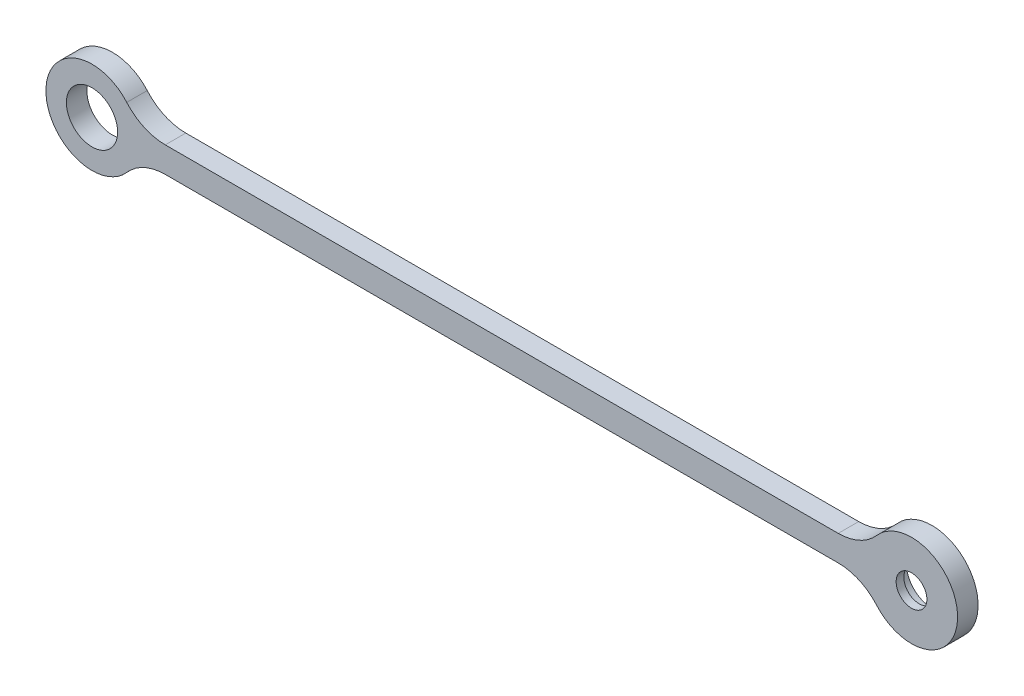
ISO-10303-21;
HEADER;
FILE_DESCRIPTION(('STEP AP214'),'2;1');
FILE_NAME('part.step','',(''),(''),'','','');
FILE_SCHEMA(('AUTOMOTIVE_DESIGN { 1 0 10303 214 1 1 1 1 }'));
ENDSEC;
DATA;
#1=APPLICATION_CONTEXT('core data for automotive mechanical design processes');
#2=APPLICATION_PROTOCOL_DEFINITION('international standard','automotive_design',2000,#1);
#3=PRODUCT_CONTEXT('',#1,'mechanical');
#4=PRODUCT('Part','Part','',(#3));
#5=PRODUCT_RELATED_PRODUCT_CATEGORY('part','',(#4));
#6=PRODUCT_DEFINITION_FORMATION('','',#4);
#7=PRODUCT_DEFINITION_CONTEXT('part definition',#1,'design');
#8=PRODUCT_DEFINITION('design','',#6,#7);
#9=PRODUCT_DEFINITION_SHAPE('','',#8);
#10=(LENGTH_UNIT() NAMED_UNIT(*) SI_UNIT(.MILLI.,.METRE.));
#11=(NAMED_UNIT(*) PLANE_ANGLE_UNIT() SI_UNIT($,.RADIAN.));
#12=(NAMED_UNIT(*) SI_UNIT($,.STERADIAN.) SOLID_ANGLE_UNIT());
#13=UNCERTAINTY_MEASURE_WITH_UNIT(LENGTH_MEASURE(1.E-05),#10,'distance_accuracy_value','');
#14=(GEOMETRIC_REPRESENTATION_CONTEXT(3) GLOBAL_UNCERTAINTY_ASSIGNED_CONTEXT((#13)) GLOBAL_UNIT_ASSIGNED_CONTEXT((#10,
#11,#12)) REPRESENTATION_CONTEXT('',''));
#15=CARTESIAN_POINT('',(0.,0.,0.));
#16=DIRECTION('',(0.,0.,1.));
#17=DIRECTION('',(1.,0.,0.));
#18=AXIS2_PLACEMENT_3D('',#15,#16,#17);
#19=CARTESIAN_POINT('',(160.,0.,4.));
#20=DIRECTION('',(0.,0.,-1.));
#21=DIRECTION('',(-1.,0.,0.));
#22=AXIS2_PLACEMENT_3D('',#19,#20,#21);
#23=CYLINDRICAL_SURFACE('',#22,5.);
#24=CARTESIAN_POINT('',(160.,0.,0.));
#25=DIRECTION('',(0.,0.,-1.));
#26=DIRECTION('',(-1.,0.,0.));
#27=AXIS2_PLACEMENT_3D('',#24,#25,#26);
#28=CIRCLE('',#27,5.);
#29=CARTESIAN_POINT('',(155.,0.,0.));
#30=VERTEX_POINT('',#29);
#31=EDGE_CURVE('E20',#30,#30,#28,.F.);
#32=ORIENTED_EDGE('',*,*,#31,.F.);
#33=EDGE_LOOP('',(#32));
#34=FACE_BOUND('',#33,.T.);
#35=CARTESIAN_POINT('',(160.,0.,2.5));
#36=DIRECTION('',(0.,0.,-1.));
#37=DIRECTION('',(-1.,0.,0.));
#38=AXIS2_PLACEMENT_3D('',#35,#36,#37);
#39=CIRCLE('',#38,5.);
#40=CARTESIAN_POINT('',(155.,0.,2.5));
#41=VERTEX_POINT('',#40);
#42=EDGE_CURVE('E147',#41,#41,#39,.F.);
#43=ORIENTED_EDGE('',*,*,#42,.T.);
#44=EDGE_LOOP('',(#43));
#45=FACE_BOUND('',#44,.T.);
#46=ADVANCED_FACE('F17',(#34,#45),#23,.F.);
#47=CARTESIAN_POINT('',(14.3090880212542,-12.5,0.));
#48=DIRECTION('',(0.,0.,-1.));
#49=DIRECTION('',(-1.,0.,0.));
#50=AXIS2_PLACEMENT_3D('',#47,#48,#49);
#51=PLANE('',#50);
#52=ORIENTED_EDGE('',*,*,#31,.T.);
#53=EDGE_LOOP('',(#52));
#54=FACE_BOUND('',#53,.T.);
#55=CARTESIAN_POINT('',(145.690911978746,-12.5,0.));
#56=DIRECTION('',(0.,0.,-1.));
#57=DIRECTION('',(-1.,0.,0.));
#58=AXIS2_PLACEMENT_3D('',#55,#56,#57);
#59=CIRCLE('',#58,10.);
#60=CARTESIAN_POINT('',(153.222010937301,-5.92105263157895,0.));
#61=VERTEX_POINT('',#60);
#62=CARTESIAN_POINT('',(145.690911978746,-2.5,0.));
#63=VERTEX_POINT('',#62);
#64=EDGE_CURVE('E137',#61,#63,#59,.F.);
#65=ORIENTED_EDGE('',*,*,#64,.T.);
#66=DIRECTION('',(-1.,0.,0.));
#67=VECTOR('',#66,1.);
#68=CARTESIAN_POINT('',(14.3090880212542,-2.5,0.));
#69=LINE('',#68,#67);
#70=CARTESIAN_POINT('',(14.3090880212542,-2.5,0.));
#71=VERTEX_POINT('',#70);
#72=EDGE_CURVE('E108',#63,#71,#69,.T.);
#73=ORIENTED_EDGE('',*,*,#72,.T.);
#74=CARTESIAN_POINT('',(14.3090880212542,-12.5,0.));
#75=DIRECTION('',(0.,0.,-1.));
#76=DIRECTION('',(-1.,0.,0.));
#77=AXIS2_PLACEMENT_3D('',#74,#75,#76);
#78=CIRCLE('',#77,10.);
#79=CARTESIAN_POINT('',(6.77798906269935,-5.92105263157895,0.));
#80=VERTEX_POINT('',#79);
#81=EDGE_CURVE('E86',#71,#80,#78,.F.);
#82=ORIENTED_EDGE('',*,*,#81,.T.);
#83=CARTESIAN_POINT('',(0.,0.,0.));
#84=DIRECTION('',(0.,0.,-1.));
#85=DIRECTION('',(-1.,0.,0.));
#86=AXIS2_PLACEMENT_3D('',#83,#84,#85);
#87=CIRCLE('',#86,9.);
#88=CARTESIAN_POINT('',(6.77798906269935,5.92105263157895,0.));
#89=VERTEX_POINT('',#88);
#90=EDGE_CURVE('E80',#89,#80,#87,.F.);
#91=ORIENTED_EDGE('',*,*,#90,.F.);
#92=CARTESIAN_POINT('',(14.3090880212542,12.5,0.));
#93=DIRECTION('',(0.,0.,-1.));
#94=DIRECTION('',(-1.,0.,0.));
#95=AXIS2_PLACEMENT_3D('',#92,#93,#94);
#96=CIRCLE('',#95,10.);
#97=CARTESIAN_POINT('',(14.3090880212542,2.5,0.));
#98=VERTEX_POINT('',#97);
#99=EDGE_CURVE('E84',#89,#98,#96,.F.);
#100=ORIENTED_EDGE('',*,*,#99,.T.);
#101=DIRECTION('',(1.,0.,0.));
#102=VECTOR('',#101,1.);
#103=CARTESIAN_POINT('',(14.3090880212542,2.5,0.));
#104=LINE('',#103,#102);
#105=CARTESIAN_POINT('',(145.690911978746,2.5,0.));
#106=VERTEX_POINT('',#105);
#107=EDGE_CURVE('E112',#98,#106,#104,.T.);
#108=ORIENTED_EDGE('',*,*,#107,.T.);
#109=CARTESIAN_POINT('',(145.690911978746,12.5,0.));
#110=DIRECTION('',(0.,0.,-1.));
#111=DIRECTION('',(-1.,0.,0.));
#112=AXIS2_PLACEMENT_3D('',#109,#110,#111);
#113=CIRCLE('',#112,10.);
#114=CARTESIAN_POINT('',(153.222010937301,5.92105263157895,0.));
#115=VERTEX_POINT('',#114);
#116=EDGE_CURVE('E143',#106,#115,#113,.F.);
#117=ORIENTED_EDGE('',*,*,#116,.T.);
#118=CARTESIAN_POINT('',(160.,0.,0.));
#119=DIRECTION('',(0.,0.,-1.));
#120=DIRECTION('',(-1.,0.,0.));
#121=AXIS2_PLACEMENT_3D('',#118,#119,#120);
#122=CIRCLE('',#121,9.00000000000001);
#123=EDGE_CURVE('E140',#61,#115,#122,.F.);
#124=ORIENTED_EDGE('',*,*,#123,.F.);
#125=EDGE_LOOP('',(#65,#73,#82,#91,#100,#108,#117,#124));
#126=FACE_BOUND('',#125,.T.);
#127=CARTESIAN_POINT('',(0.,0.,0.));
#128=DIRECTION('',(0.,0.,-1.));
#129=DIRECTION('',(-1.,0.,0.));
#130=AXIS2_PLACEMENT_3D('',#127,#128,#129);
#131=CIRCLE('',#130,5.);
#132=CARTESIAN_POINT('',(-5.,0.,0.));
#133=VERTEX_POINT('',#132);
#134=EDGE_CURVE('E92',#133,#133,#131,.F.);
#135=ORIENTED_EDGE('',*,*,#134,.T.);
#136=EDGE_LOOP('',(#135));
#137=FACE_BOUND('',#136,.T.);
#138=ADVANCED_FACE('F82',(#54,#126,#137),#51,.T.);
#139=CARTESIAN_POINT('',(160.,0.,2.5));
#140=DIRECTION('',(0.,0.,1.));
#141=DIRECTION('',(1.,0.,0.));
#142=AXIS2_PLACEMENT_3D('',#139,#140,#141);
#143=PLANE('',#142);
#144=ORIENTED_EDGE('',*,*,#42,.F.);
#145=EDGE_LOOP('',(#144));
#146=FACE_BOUND('',#145,.T.);
#147=CARTESIAN_POINT('',(160.,0.,2.5));
#148=DIRECTION('',(0.,0.,1.));
#149=DIRECTION('',(1.,0.,0.));
#150=AXIS2_PLACEMENT_3D('',#147,#148,#149);
#151=CIRCLE('',#150,3.00000000000011);
#152=CARTESIAN_POINT('',(163.,0.,2.5));
#153=VERTEX_POINT('',#152);
#154=EDGE_CURVE('E133',#153,#153,#151,.T.);
#155=ORIENTED_EDGE('',*,*,#154,.T.);
#156=EDGE_LOOP('',(#155));
#157=FACE_BOUND('',#156,.T.);
#158=ADVANCED_FACE('F160',(#146,#157),#143,.F.);
#159=CARTESIAN_POINT('',(0.,0.,4.));
#160=DIRECTION('',(0.,0.,-1.));
#161=DIRECTION('',(-1.,0.,0.));
#162=AXIS2_PLACEMENT_3D('',#159,#160,#161);
#163=CYLINDRICAL_SURFACE('',#162,5.);
#164=ORIENTED_EDGE('',*,*,#134,.F.);
#165=EDGE_LOOP('',(#164));
#166=FACE_BOUND('',#165,.T.);
#167=CARTESIAN_POINT('',(0.,0.,4.));
#168=DIRECTION('',(0.,0.,-1.));
#169=DIRECTION('',(-1.,0.,0.));
#170=AXIS2_PLACEMENT_3D('',#167,#168,#169);
#171=CIRCLE('',#170,5.);
#172=CARTESIAN_POINT('',(-5.,0.,4.));
#173=VERTEX_POINT('',#172);
#174=EDGE_CURVE('E130',#173,#173,#171,.F.);
#175=ORIENTED_EDGE('',*,*,#174,.T.);
#176=EDGE_LOOP('',(#175));
#177=FACE_BOUND('',#176,.T.);
#178=ADVANCED_FACE('F201',(#166,#177),#163,.F.);
#179=CARTESIAN_POINT('',(0.,0.,4.));
#180=DIRECTION('',(0.,0.,-1.));
#181=DIRECTION('',(-1.,0.,0.));
#182=AXIS2_PLACEMENT_3D('',#179,#180,#181);
#183=CYLINDRICAL_SURFACE('',#182,9.);
#184=DIRECTION('',(0.,0.,-1.));
#185=VECTOR('',#184,1.);
#186=CARTESIAN_POINT('',(6.77798906269935,5.92105263157894,4.));
#187=LINE('',#186,#185);
#188=CARTESIAN_POINT('',(6.77798906269935,5.92105263157895,4.));
#189=VERTEX_POINT('',#188);
#190=EDGE_CURVE('E91',#189,#89,#187,.T.);
#191=ORIENTED_EDGE('',*,*,#190,.T.);
#192=ORIENTED_EDGE('',*,*,#90,.T.);
#193=DIRECTION('',(0.,0.,-1.));
#194=VECTOR('',#193,1.);
#195=CARTESIAN_POINT('',(6.77798906269935,-5.92105263157895,4.));
#196=LINE('',#195,#194);
#197=CARTESIAN_POINT('',(6.77798906269935,-5.92105263157895,4.));
#198=VERTEX_POINT('',#197);
#199=EDGE_CURVE('E110',#80,#198,#196,.F.);
#200=ORIENTED_EDGE('',*,*,#199,.T.);
#201=CARTESIAN_POINT('',(0.,0.,4.));
#202=DIRECTION('',(0.,0.,-1.));
#203=DIRECTION('',(-1.,0.,0.));
#204=AXIS2_PLACEMENT_3D('',#201,#202,#203);
#205=CIRCLE('',#204,9.);
#206=EDGE_CURVE('E103',#198,#189,#205,.T.);
#207=ORIENTED_EDGE('',*,*,#206,.T.);
#208=EDGE_LOOP('',(#191,#192,#200,#207));
#209=FACE_BOUND('',#208,.T.);
#210=ADVANCED_FACE('F102',(#209),#183,.T.);
#211=CARTESIAN_POINT('',(14.3090880212542,12.5,4.));
#212=DIRECTION('',(0.,0.,-1.));
#213=DIRECTION('',(-1.,0.,0.));
#214=AXIS2_PLACEMENT_3D('',#211,#212,#213);
#215=CYLINDRICAL_SURFACE('',#214,10.);
#216=ORIENTED_EDGE('',*,*,#190,.F.);
#217=CARTESIAN_POINT('',(14.3090880212542,12.5,4.));
#218=DIRECTION('',(0.,0.,-1.));
#219=DIRECTION('',(-1.,0.,0.));
#220=AXIS2_PLACEMENT_3D('',#217,#218,#219);
#221=CIRCLE('',#220,10.);
#222=CARTESIAN_POINT('',(14.3090880212542,2.5,4.));
#223=VERTEX_POINT('',#222);
#224=EDGE_CURVE('E127',#189,#223,#221,.F.);
#225=ORIENTED_EDGE('',*,*,#224,.T.);
#226=DIRECTION('',(0.,0.,1.));
#227=VECTOR('',#226,1.);
#228=CARTESIAN_POINT('',(14.3090880212542,2.5,4.));
#229=LINE('',#228,#227);
#230=EDGE_CURVE('E100',#223,#98,#229,.F.);
#231=ORIENTED_EDGE('',*,*,#230,.T.);
#232=ORIENTED_EDGE('',*,*,#99,.F.);
#233=EDGE_LOOP('',(#216,#225,#231,#232));
#234=FACE_BOUND('',#233,.T.);
#235=ADVANCED_FACE('F97',(#234),#215,.F.);
#236=CARTESIAN_POINT('',(14.3090880212542,2.5,4.));
#237=DIRECTION('',(0.,-1.,0.));
#238=DIRECTION('',(1.,0.,0.));
#239=AXIS2_PLACEMENT_3D('',#236,#237,#238);
#240=PLANE('',#239);
#241=ORIENTED_EDGE('',*,*,#230,.F.);
#242=DIRECTION('',(-1.,0.,0.));
#243=VECTOR('',#242,1.);
#244=CARTESIAN_POINT('',(14.3090880212542,2.5,4.));
#245=LINE('',#244,#243);
#246=CARTESIAN_POINT('',(145.690911978746,2.5,4.));
#247=VERTEX_POINT('',#246);
#248=EDGE_CURVE('E126',#223,#247,#245,.F.);
#249=ORIENTED_EDGE('',*,*,#248,.T.);
#250=DIRECTION('',(0.,0.,-1.));
#251=VECTOR('',#250,1.);
#252=CARTESIAN_POINT('',(145.690911978746,2.49999999999999,4.));
#253=LINE('',#252,#251);
#254=EDGE_CURVE('E113',#247,#106,#253,.T.);
#255=ORIENTED_EDGE('',*,*,#254,.T.);
#256=ORIENTED_EDGE('',*,*,#107,.F.);
#257=EDGE_LOOP('',(#241,#249,#255,#256));
#258=FACE_BOUND('',#257,.T.);
#259=ADVANCED_FACE('F192',(#258),#240,.F.);
#260=CARTESIAN_POINT('',(145.690911978746,12.5,4.));
#261=DIRECTION('',(0.,0.,-1.));
#262=DIRECTION('',(-1.,0.,0.));
#263=AXIS2_PLACEMENT_3D('',#260,#261,#262);
#264=CYLINDRICAL_SURFACE('',#263,10.);
#265=ORIENTED_EDGE('',*,*,#254,.F.);
#266=CARTESIAN_POINT('',(145.690911978746,12.5,4.));
#267=DIRECTION('',(0.,0.,-1.));
#268=DIRECTION('',(-1.,0.,0.));
#269=AXIS2_PLACEMENT_3D('',#266,#267,#268);
#270=CIRCLE('',#269,10.);
#271=CARTESIAN_POINT('',(153.222010937301,5.92105263157895,4.));
#272=VERTEX_POINT('',#271);
#273=EDGE_CURVE('E123',#247,#272,#270,.F.);
#274=ORIENTED_EDGE('',*,*,#273,.T.);
#275=DIRECTION('',(0.,0.,-1.));
#276=VECTOR('',#275,1.);
#277=CARTESIAN_POINT('',(153.222010937301,5.92105263157895,4.));
#278=LINE('',#277,#276);
#279=EDGE_CURVE('E142',#115,#272,#278,.F.);
#280=ORIENTED_EDGE('',*,*,#279,.F.);
#281=ORIENTED_EDGE('',*,*,#116,.F.);
#282=EDGE_LOOP('',(#265,#274,#280,#281));
#283=FACE_BOUND('',#282,.T.);
#284=ADVANCED_FACE('F188',(#283),#264,.F.);
#285=CARTESIAN_POINT('',(160.,0.,4.));
#286=DIRECTION('',(0.,0.,-1.));
#287=DIRECTION('',(-1.,0.,0.));
#288=AXIS2_PLACEMENT_3D('',#285,#286,#287);
#289=CYLINDRICAL_SURFACE('',#288,9.00000000000001);
#290=CARTESIAN_POINT('',(160.,0.,4.));
#291=DIRECTION('',(0.,0.,-1.));
#292=DIRECTION('',(-1.,0.,0.));
#293=AXIS2_PLACEMENT_3D('',#290,#291,#292);
#294=CIRCLE('',#293,9.00000000000001);
#295=CARTESIAN_POINT('',(153.222010937301,-5.92105263157894,4.));
#296=VERTEX_POINT('',#295);
#297=EDGE_CURVE('E120',#272,#296,#294,.T.);
#298=ORIENTED_EDGE('',*,*,#297,.T.);
#299=DIRECTION('',(0.,0.,-1.));
#300=VECTOR('',#299,1.);
#301=CARTESIAN_POINT('',(153.222010937301,-5.92105263157894,4.));
#302=LINE('',#301,#300);
#303=EDGE_CURVE('E139',#296,#61,#302,.T.);
#304=ORIENTED_EDGE('',*,*,#303,.T.);
#305=ORIENTED_EDGE('',*,*,#123,.T.);
#306=ORIENTED_EDGE('',*,*,#279,.T.);
#307=EDGE_LOOP('',(#298,#304,#305,#306));
#308=FACE_BOUND('',#307,.T.);
#309=ADVANCED_FACE('F184',(#308),#289,.T.);
#310=CARTESIAN_POINT('',(145.690911978746,-12.5,4.));
#311=DIRECTION('',(0.,0.,-1.));
#312=DIRECTION('',(-1.,0.,0.));
#313=AXIS2_PLACEMENT_3D('',#310,#311,#312);
#314=CYLINDRICAL_SURFACE('',#313,10.);
#315=ORIENTED_EDGE('',*,*,#303,.F.);
#316=CARTESIAN_POINT('',(145.690911978746,-12.5,4.));
#317=DIRECTION('',(0.,0.,-1.));
#318=DIRECTION('',(-1.,0.,0.));
#319=AXIS2_PLACEMENT_3D('',#316,#317,#318);
#320=CIRCLE('',#319,10.);
#321=CARTESIAN_POINT('',(145.690911978746,-2.5,4.));
#322=VERTEX_POINT('',#321);
#323=EDGE_CURVE('E117',#296,#322,#320,.F.);
#324=ORIENTED_EDGE('',*,*,#323,.T.);
#325=DIRECTION('',(0.,0.,1.));
#326=VECTOR('',#325,1.);
#327=CARTESIAN_POINT('',(145.690911978746,-2.5,4.));
#328=LINE('',#327,#326);
#329=EDGE_CURVE('E111',#322,#63,#328,.F.);
#330=ORIENTED_EDGE('',*,*,#329,.T.);
#331=ORIENTED_EDGE('',*,*,#64,.F.);
#332=EDGE_LOOP('',(#315,#324,#330,#331));
#333=FACE_BOUND('',#332,.T.);
#334=ADVANCED_FACE('F180',(#333),#314,.F.);
#335=CARTESIAN_POINT('',(14.3090880212542,-2.5,4.));
#336=DIRECTION('',(0.,1.,0.));
#337=DIRECTION('',(-1.,0.,0.));
#338=AXIS2_PLACEMENT_3D('',#335,#336,#337);
#339=PLANE('',#338);
#340=ORIENTED_EDGE('',*,*,#329,.F.);
#341=DIRECTION('',(-1.,0.,0.));
#342=VECTOR('',#341,1.);
#343=CARTESIAN_POINT('',(14.3090880212542,-2.5,4.));
#344=LINE('',#343,#342);
#345=CARTESIAN_POINT('',(14.3090880212542,-2.5,4.));
#346=VERTEX_POINT('',#345);
#347=EDGE_CURVE('E116',#322,#346,#344,.T.);
#348=ORIENTED_EDGE('',*,*,#347,.T.);
#349=DIRECTION('',(0.,0.,-1.));
#350=VECTOR('',#349,1.);
#351=CARTESIAN_POINT('',(14.3090880212542,-2.5,4.));
#352=LINE('',#351,#350);
#353=EDGE_CURVE('E35',#346,#71,#352,.T.);
#354=ORIENTED_EDGE('',*,*,#353,.T.);
#355=ORIENTED_EDGE('',*,*,#72,.F.);
#356=EDGE_LOOP('',(#340,#348,#354,#355));
#357=FACE_BOUND('',#356,.T.);
#358=ADVANCED_FACE('F177',(#357),#339,.F.);
#359=CARTESIAN_POINT('',(14.3090880212542,-12.5,4.));
#360=DIRECTION('',(0.,0.,-1.));
#361=DIRECTION('',(-1.,0.,0.));
#362=AXIS2_PLACEMENT_3D('',#359,#360,#361);
#363=CYLINDRICAL_SURFACE('',#362,10.);
#364=ORIENTED_EDGE('',*,*,#353,.F.);
#365=CARTESIAN_POINT('',(14.3090880212542,-12.5,4.));
#366=DIRECTION('',(0.,0.,-1.));
#367=DIRECTION('',(-1.,0.,0.));
#368=AXIS2_PLACEMENT_3D('',#365,#366,#367);
#369=CIRCLE('',#368,10.);
#370=EDGE_CURVE('E26',#346,#198,#369,.F.);
#371=ORIENTED_EDGE('',*,*,#370,.T.);
#372=ORIENTED_EDGE('',*,*,#199,.F.);
#373=ORIENTED_EDGE('',*,*,#81,.F.);
#374=EDGE_LOOP('',(#364,#371,#372,#373));
#375=FACE_BOUND('',#374,.T.);
#376=ADVANCED_FACE('F169',(#375),#363,.F.);
#377=CARTESIAN_POINT('',(160.,0.,2.5));
#378=DIRECTION('',(0.,0.,1.));
#379=DIRECTION('',(1.,0.,0.));
#380=AXIS2_PLACEMENT_3D('',#377,#378,#379);
#381=CYLINDRICAL_SURFACE('',#380,3.00000000000011);
#382=ORIENTED_EDGE('',*,*,#154,.F.);
#383=EDGE_LOOP('',(#382));
#384=FACE_BOUND('',#383,.T.);
#385=CARTESIAN_POINT('',(160.,0.,4.));
#386=DIRECTION('',(0.,0.,1.));
#387=DIRECTION('',(1.,0.,0.));
#388=AXIS2_PLACEMENT_3D('',#385,#386,#387);
#389=CIRCLE('',#388,3.00000000000011);
#390=CARTESIAN_POINT('',(163.,0.,4.));
#391=VERTEX_POINT('',#390);
#392=EDGE_CURVE('E11',#391,#391,#389,.T.);
#393=ORIENTED_EDGE('',*,*,#392,.T.);
#394=EDGE_LOOP('',(#393));
#395=FACE_BOUND('',#394,.T.);
#396=ADVANCED_FACE('F163',(#384,#395),#381,.F.);
#397=CARTESIAN_POINT('',(14.3090880212542,-12.5,4.));
#398=DIRECTION('',(0.,0.,-1.));
#399=DIRECTION('',(-1.,0.,0.));
#400=AXIS2_PLACEMENT_3D('',#397,#398,#399);
#401=PLANE('',#400);
#402=ORIENTED_EDGE('',*,*,#392,.F.);
#403=EDGE_LOOP('',(#402));
#404=FACE_BOUND('',#403,.T.);
#405=ORIENTED_EDGE('',*,*,#347,.F.);
#406=ORIENTED_EDGE('',*,*,#323,.F.);
#407=ORIENTED_EDGE('',*,*,#297,.F.);
#408=ORIENTED_EDGE('',*,*,#273,.F.);
#409=ORIENTED_EDGE('',*,*,#248,.F.);
#410=ORIENTED_EDGE('',*,*,#224,.F.);
#411=ORIENTED_EDGE('',*,*,#206,.F.);
#412=ORIENTED_EDGE('',*,*,#370,.F.);
#413=EDGE_LOOP('',(#405,#406,#407,#408,#409,#410,#411,#412));
#414=FACE_BOUND('',#413,.T.);
#415=ORIENTED_EDGE('',*,*,#174,.F.);
#416=EDGE_LOOP('',(#415));
#417=FACE_BOUND('',#416,.T.);
#418=ADVANCED_FACE('F161',(#404,#414,#417),#401,.F.);
#419=CLOSED_SHELL('',(#46,#138,#158,#178,#210,#235,#259,#284,#309,#334,#358,#376,#396,#418));
#420=MANIFOLD_SOLID_BREP('B1',#419);
#421=ADVANCED_BREP_SHAPE_REPRESENTATION('',(#18,#420),#14);
#422=SHAPE_DEFINITION_REPRESENTATION(#9,#421);
ENDSEC;
END-ISO-10303-21;
